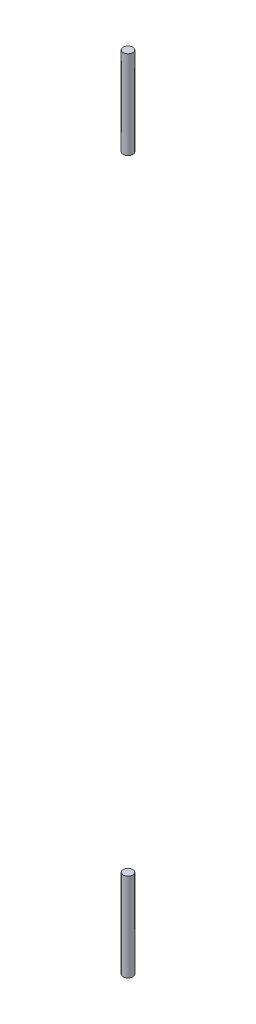
ISO-10303-21;
HEADER;
FILE_DESCRIPTION(('STEP AP214'),'2;1');
FILE_NAME('part.step','',(''),(''),'','','');
FILE_SCHEMA(('AUTOMOTIVE_DESIGN { 1 0 10303 214 1 1 1 1 }'));
ENDSEC;
DATA;
#1=APPLICATION_CONTEXT('core data for automotive mechanical design processes');
#2=APPLICATION_PROTOCOL_DEFINITION('international standard','automotive_design',2000,#1);
#3=PRODUCT_CONTEXT('',#1,'mechanical');
#4=PRODUCT('Part','Part','',(#3));
#5=PRODUCT_RELATED_PRODUCT_CATEGORY('part','',(#4));
#6=PRODUCT_DEFINITION_FORMATION('','',#4);
#7=PRODUCT_DEFINITION_CONTEXT('part definition',#1,'design');
#8=PRODUCT_DEFINITION('design','',#6,#7);
#9=PRODUCT_DEFINITION_SHAPE('','',#8);
#10=(LENGTH_UNIT() NAMED_UNIT(*) SI_UNIT(.MILLI.,.METRE.));
#11=(NAMED_UNIT(*) PLANE_ANGLE_UNIT() SI_UNIT($,.RADIAN.));
#12=(NAMED_UNIT(*) SI_UNIT($,.STERADIAN.) SOLID_ANGLE_UNIT());
#13=UNCERTAINTY_MEASURE_WITH_UNIT(LENGTH_MEASURE(1.E-05),#10,'distance_accuracy_value','');
#14=(GEOMETRIC_REPRESENTATION_CONTEXT(3) GLOBAL_UNCERTAINTY_ASSIGNED_CONTEXT((#13)) GLOBAL_UNIT_ASSIGNED_CONTEXT((#10,
#11,#12)) REPRESENTATION_CONTEXT('',''));
#15=CARTESIAN_POINT('',(0.,0.,0.));
#16=DIRECTION('',(0.,0.,1.));
#17=DIRECTION('',(1.,0.,0.));
#18=AXIS2_PLACEMENT_3D('',#15,#16,#17);
#19=CARTESIAN_POINT('',(269.702081562383,-318.396293784739,21.26781930824));
#20=DIRECTION('',(0.,1.,0.));
#21=DIRECTION('',(0.,0.,1.));
#22=AXIS2_PLACEMENT_3D('',#19,#20,#21);
#23=CYLINDRICAL_SURFACE('',#22,3.17499999999997);
#24=CARTESIAN_POINT('',(269.702081562383,-250.916087489065,21.26781930824));
#25=DIRECTION('',(0.,-1.,0.));
#26=DIRECTION('',(0.,0.,-1.));
#27=AXIS2_PLACEMENT_3D('',#24,#25,#26);
#28=CIRCLE('',#27,3.17499999999997);
#29=CARTESIAN_POINT('',(269.702081562383,-250.916087489065,18.09281930824));
#30=VERTEX_POINT('',#29);
#31=EDGE_CURVE('E52',#30,#30,#28,.T.);
#32=ORIENTED_EDGE('',*,*,#31,.T.);
#33=EDGE_LOOP('',(#32));
#34=FACE_BOUND('',#33,.T.);
#35=CARTESIAN_POINT('',(269.702081562383,-309.416037663669,21.26781930824));
#36=DIRECTION('',(0.,-1.,0.));
#37=DIRECTION('',(0.,0.,-1.));
#38=AXIS2_PLACEMENT_3D('',#35,#36,#37);
#39=CIRCLE('',#38,3.17499999999997);
#40=CARTESIAN_POINT('',(269.702081562383,-309.416037663669,18.09281930824));
#41=VERTEX_POINT('',#40);
#42=EDGE_CURVE('E11',#41,#41,#39,.T.);
#43=ORIENTED_EDGE('',*,*,#42,.F.);
#44=EDGE_LOOP('',(#43));
#45=FACE_BOUND('',#44,.T.);
#46=ADVANCED_FACE('F45',(#34,#45),#23,.T.);
#47=CARTESIAN_POINT('',(269.702081562383,-250.916087489065,21.26781930824));
#48=DIRECTION('',(0.,-1.,0.));
#49=DIRECTION('',(0.,0.,-1.));
#50=AXIS2_PLACEMENT_3D('',#47,#48,#49);
#51=PLANE('',#50);
#52=ORIENTED_EDGE('',*,*,#31,.F.);
#53=EDGE_LOOP('',(#52));
#54=FACE_BOUND('',#53,.T.);
#55=ADVANCED_FACE('F60',(#54),#51,.F.);
#56=CARTESIAN_POINT('',(0.,-309.416037663669,0.));
#57=DIRECTION('',(0.,-1.,0.));
#58=DIRECTION('',(0.,0.,-1.));
#59=AXIS2_PLACEMENT_3D('',#56,#57,#58);
#60=PLANE('',#59);
#61=ORIENTED_EDGE('',*,*,#42,.T.);
#62=EDGE_LOOP('',(#61));
#63=FACE_BOUND('',#62,.T.);
#64=ADVANCED_FACE('F47',(#63),#60,.T.);
#65=CLOSED_SHELL('',(#46,#55,#64));
#66=MANIFOLD_SOLID_BREP('B2',#65);
#67=CARTESIAN_POINT('',(269.702081562388,221.304262336332,21.2678193082401));
#68=DIRECTION('',(0.,-1.,0.));
#69=DIRECTION('',(0.,0.,-1.));
#70=AXIS2_PLACEMENT_3D('',#67,#68,#69);
#71=PLANE('',#70);
#72=CARTESIAN_POINT('',(269.702081562388,221.304262336332,21.2678193082401));
#73=DIRECTION('',(0.,-1.,0.));
#74=DIRECTION('',(0.,0.,-1.));
#75=AXIS2_PLACEMENT_3D('',#72,#73,#74);
#76=CIRCLE('',#75,3.17499999999997);
#77=CARTESIAN_POINT('',(269.702081562388,221.304262336332,18.0928193082402));
#78=VERTEX_POINT('',#77);
#79=EDGE_CURVE('E100',#78,#78,#76,.T.);
#80=ORIENTED_EDGE('',*,*,#79,.F.);
#81=EDGE_LOOP('',(#80));
#82=FACE_BOUND('',#81,.T.);
#83=ADVANCED_FACE('F93',(#82),#71,.F.);
#84=CARTESIAN_POINT('',(269.702081562388,153.824056040653,21.2678193082401));
#85=DIRECTION('',(0.,1.,0.));
#86=DIRECTION('',(0.,0.,1.));
#87=AXIS2_PLACEMENT_3D('',#84,#85,#86);
#88=CYLINDRICAL_SURFACE('',#87,3.17499999999997);
#89=CARTESIAN_POINT('',(269.702081562388,162.804312161722,21.2678193082401));
#90=DIRECTION('',(0.,1.,0.));
#91=DIRECTION('',(0.,0.,1.));
#92=AXIS2_PLACEMENT_3D('',#89,#90,#91);
#93=CIRCLE('',#92,3.17499999999997);
#94=CARTESIAN_POINT('',(269.702081562388,162.804312161722,24.4428193082401));
#95=VERTEX_POINT('',#94);
#96=EDGE_CURVE('E44',#95,#95,#93,.T.);
#97=ORIENTED_EDGE('',*,*,#96,.T.);
#98=EDGE_LOOP('',(#97));
#99=FACE_BOUND('',#98,.T.);
#100=ORIENTED_EDGE('',*,*,#79,.T.);
#101=EDGE_LOOP('',(#100));
#102=FACE_BOUND('',#101,.T.);
#103=ADVANCED_FACE('F95',(#99,#102),#88,.T.);
#104=CARTESIAN_POINT('',(0.,162.804312161722,0.));
#105=DIRECTION('',(0.,1.,0.));
#106=DIRECTION('',(0.,0.,1.));
#107=AXIS2_PLACEMENT_3D('',#104,#105,#106);
#108=PLANE('',#107);
#109=ORIENTED_EDGE('',*,*,#96,.F.);
#110=EDGE_LOOP('',(#109));
#111=FACE_BOUND('',#110,.T.);
#112=ADVANCED_FACE('F111',(#111),#108,.F.);
#113=CLOSED_SHELL('',(#83,#103,#112));
#114=MANIFOLD_SOLID_BREP('B6',#113);
#115=ADVANCED_BREP_SHAPE_REPRESENTATION('',(#18,#66,#114),#14);
#116=SHAPE_DEFINITION_REPRESENTATION(#9,#115);
ENDSEC;
END-ISO-10303-21;
